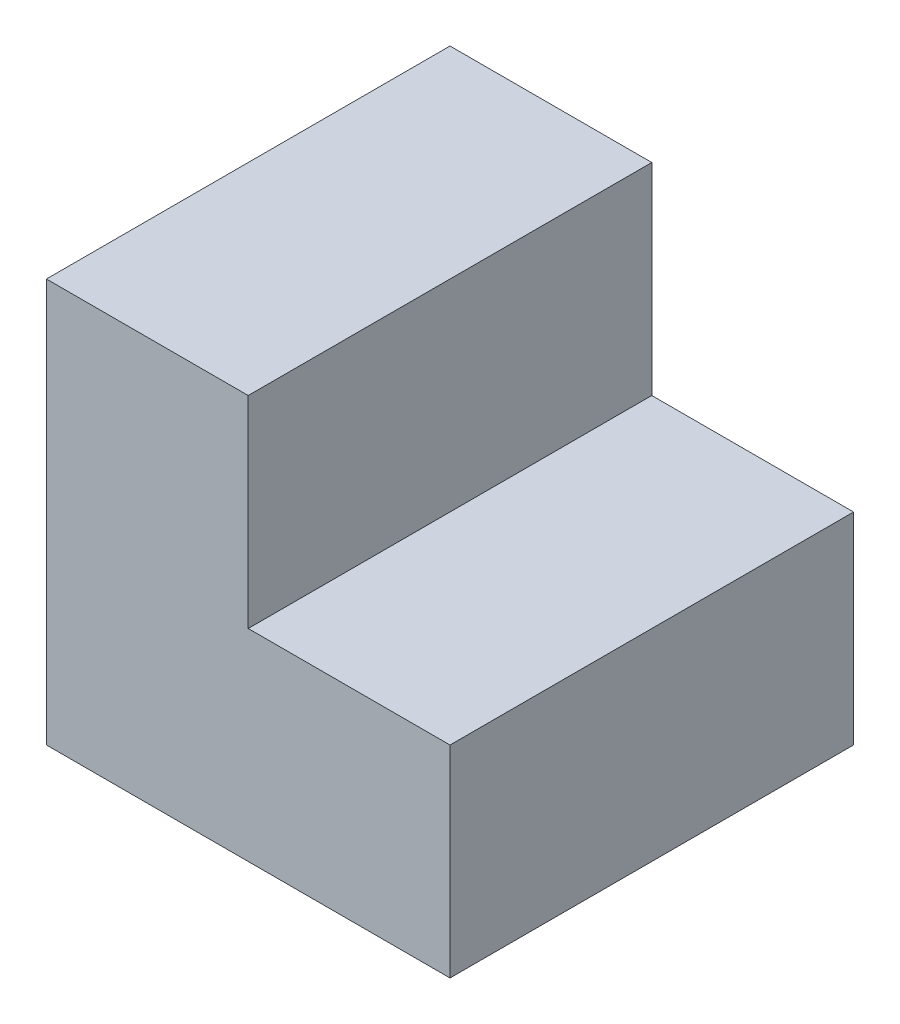
ISO-10303-21;
HEADER;
FILE_DESCRIPTION(('STEP AP214'),'2;1');
FILE_NAME('part.step','',(''),(''),'','','');
FILE_SCHEMA(('AUTOMOTIVE_DESIGN { 1 0 10303 214 1 1 1 1 }'));
ENDSEC;
DATA;
#1=APPLICATION_CONTEXT('core data for automotive mechanical design processes');
#2=APPLICATION_PROTOCOL_DEFINITION('international standard','automotive_design',2000,#1);
#3=PRODUCT_CONTEXT('',#1,'mechanical');
#4=PRODUCT('Part','Part','',(#3));
#5=PRODUCT_RELATED_PRODUCT_CATEGORY('part','',(#4));
#6=PRODUCT_DEFINITION_FORMATION('','',#4);
#7=PRODUCT_DEFINITION_CONTEXT('part definition',#1,'design');
#8=PRODUCT_DEFINITION('design','',#6,#7);
#9=PRODUCT_DEFINITION_SHAPE('','',#8);
#10=(LENGTH_UNIT() NAMED_UNIT(*) SI_UNIT(.MILLI.,.METRE.));
#11=(NAMED_UNIT(*) PLANE_ANGLE_UNIT() SI_UNIT($,.RADIAN.));
#12=(NAMED_UNIT(*) SI_UNIT($,.STERADIAN.) SOLID_ANGLE_UNIT());
#13=UNCERTAINTY_MEASURE_WITH_UNIT(LENGTH_MEASURE(1.E-05),#10,'distance_accuracy_value','');
#14=(GEOMETRIC_REPRESENTATION_CONTEXT(3) GLOBAL_UNCERTAINTY_ASSIGNED_CONTEXT((#13)) GLOBAL_UNIT_ASSIGNED_CONTEXT((#10,
#11,#12)) REPRESENTATION_CONTEXT('',''));
#15=CARTESIAN_POINT('',(0.,0.,0.));
#16=DIRECTION('',(0.,0.,1.));
#17=DIRECTION('',(1.,0.,0.));
#18=AXIS2_PLACEMENT_3D('',#15,#16,#17);
#19=CARTESIAN_POINT('',(80.,40.,-80.));
#20=DIRECTION('',(0.,1.,0.));
#21=DIRECTION('',(-1.,0.,0.));
#22=AXIS2_PLACEMENT_3D('',#19,#20,#21);
#23=PLANE('',#22);
#24=DIRECTION('',(-1.,0.,0.));
#25=VECTOR('',#24,1.);
#26=CARTESIAN_POINT('',(80.,40.,0.));
#27=LINE('',#26,#25);
#28=CARTESIAN_POINT('',(80.,40.,0.));
#29=VERTEX_POINT('',#28);
#30=CARTESIAN_POINT('',(40.,40.,0.));
#31=VERTEX_POINT('',#30);
#32=EDGE_CURVE('E118',#29,#31,#27,.T.);
#33=ORIENTED_EDGE('',*,*,#32,.F.);
#34=DIRECTION('',(0.,0.,1.));
#35=VECTOR('',#34,1.);
#36=CARTESIAN_POINT('',(80.,40.,-80.));
#37=LINE('',#36,#35);
#38=CARTESIAN_POINT('',(80.,40.,-80.));
#39=VERTEX_POINT('',#38);
#40=EDGE_CURVE('E11',#39,#29,#37,.T.);
#41=ORIENTED_EDGE('',*,*,#40,.F.);
#42=DIRECTION('',(-1.,0.,0.));
#43=VECTOR('',#42,1.);
#44=CARTESIAN_POINT('',(80.,40.,-80.));
#45=LINE('',#44,#43);
#46=CARTESIAN_POINT('',(40.,40.,-80.));
#47=VERTEX_POINT('',#46);
#48=EDGE_CURVE('E132',#39,#47,#45,.T.);
#49=ORIENTED_EDGE('',*,*,#48,.T.);
#50=DIRECTION('',(0.,0.,1.));
#51=VECTOR('',#50,1.);
#52=CARTESIAN_POINT('',(40.,40.,-80.));
#53=LINE('',#52,#51);
#54=EDGE_CURVE('E36',#47,#31,#53,.T.);
#55=ORIENTED_EDGE('',*,*,#54,.T.);
#56=EDGE_LOOP('',(#33,#41,#49,#55));
#57=FACE_BOUND('',#56,.T.);
#58=ADVANCED_FACE('F33',(#57),#23,.T.);
#59=CARTESIAN_POINT('',(80.,0.,-80.));
#60=DIRECTION('',(1.,0.,0.));
#61=DIRECTION('',(0.,0.,-1.));
#62=AXIS2_PLACEMENT_3D('',#59,#60,#61);
#63=PLANE('',#62);
#64=DIRECTION('',(0.,1.,0.));
#65=VECTOR('',#64,1.);
#66=CARTESIAN_POINT('',(80.,0.,0.));
#67=LINE('',#66,#65);
#68=CARTESIAN_POINT('',(80.,0.,0.));
#69=VERTEX_POINT('',#68);
#70=EDGE_CURVE('E130',#69,#29,#67,.T.);
#71=ORIENTED_EDGE('',*,*,#70,.F.);
#72=DIRECTION('',(0.,0.,1.));
#73=VECTOR('',#72,1.);
#74=CARTESIAN_POINT('',(80.,0.,-80.));
#75=LINE('',#74,#73);
#76=CARTESIAN_POINT('',(80.,0.,-80.));
#77=VERTEX_POINT('',#76);
#78=EDGE_CURVE('E42',#77,#69,#75,.T.);
#79=ORIENTED_EDGE('',*,*,#78,.F.);
#80=DIRECTION('',(0.,1.,0.));
#81=VECTOR('',#80,1.);
#82=CARTESIAN_POINT('',(80.,0.,-80.));
#83=LINE('',#82,#81);
#84=EDGE_CURVE('E108',#77,#39,#83,.T.);
#85=ORIENTED_EDGE('',*,*,#84,.T.);
#86=ORIENTED_EDGE('',*,*,#40,.T.);
#87=EDGE_LOOP('',(#71,#79,#85,#86));
#88=FACE_BOUND('',#87,.T.);
#89=ADVANCED_FACE('F140',(#88),#63,.T.);
#90=CARTESIAN_POINT('',(0.,0.,-80.));
#91=DIRECTION('',(0.,-1.,0.));
#92=DIRECTION('',(0.,0.,-1.));
#93=AXIS2_PLACEMENT_3D('',#90,#91,#92);
#94=PLANE('',#93);
#95=DIRECTION('',(1.,0.,0.));
#96=VECTOR('',#95,1.);
#97=CARTESIAN_POINT('',(0.,0.,0.));
#98=LINE('',#97,#96);
#99=CARTESIAN_POINT('',(0.,0.,0.));
#100=VERTEX_POINT('',#99);
#101=EDGE_CURVE('E95',#100,#69,#98,.T.);
#102=ORIENTED_EDGE('',*,*,#101,.F.);
#103=DIRECTION('',(0.,0.,1.));
#104=VECTOR('',#103,1.);
#105=CARTESIAN_POINT('',(0.,0.,-80.));
#106=LINE('',#105,#104);
#107=CARTESIAN_POINT('',(0.,0.,-80.));
#108=VERTEX_POINT('',#107);
#109=EDGE_CURVE('E90',#108,#100,#106,.T.);
#110=ORIENTED_EDGE('',*,*,#109,.F.);
#111=DIRECTION('',(1.,0.,0.));
#112=VECTOR('',#111,1.);
#113=CARTESIAN_POINT('',(0.,0.,-80.));
#114=LINE('',#113,#112);
#115=EDGE_CURVE('E93',#108,#77,#114,.T.);
#116=ORIENTED_EDGE('',*,*,#115,.T.);
#117=ORIENTED_EDGE('',*,*,#78,.T.);
#118=EDGE_LOOP('',(#102,#110,#116,#117));
#119=FACE_BOUND('',#118,.T.);
#120=ADVANCED_FACE('F92',(#119),#94,.T.);
#121=CARTESIAN_POINT('',(0.,80.,-80.));
#122=DIRECTION('',(-1.,0.,0.));
#123=DIRECTION('',(0.,-1.,0.));
#124=AXIS2_PLACEMENT_3D('',#121,#122,#123);
#125=PLANE('',#124);
#126=DIRECTION('',(0.,-1.,0.));
#127=VECTOR('',#126,1.);
#128=CARTESIAN_POINT('',(0.,80.,0.));
#129=LINE('',#128,#127);
#130=CARTESIAN_POINT('',(0.,80.,0.));
#131=VERTEX_POINT('',#130);
#132=EDGE_CURVE('E127',#131,#100,#129,.T.);
#133=ORIENTED_EDGE('',*,*,#132,.F.);
#134=DIRECTION('',(0.,0.,1.));
#135=VECTOR('',#134,1.);
#136=CARTESIAN_POINT('',(0.,80.,-80.));
#137=LINE('',#136,#135);
#138=CARTESIAN_POINT('',(0.,80.,-80.));
#139=VERTEX_POINT('',#138);
#140=EDGE_CURVE('E100',#139,#131,#137,.T.);
#141=ORIENTED_EDGE('',*,*,#140,.F.);
#142=DIRECTION('',(0.,-1.,0.));
#143=VECTOR('',#142,1.);
#144=CARTESIAN_POINT('',(0.,80.,-80.));
#145=LINE('',#144,#143);
#146=EDGE_CURVE('E106',#139,#108,#145,.T.);
#147=ORIENTED_EDGE('',*,*,#146,.T.);
#148=ORIENTED_EDGE('',*,*,#109,.T.);
#149=EDGE_LOOP('',(#133,#141,#147,#148));
#150=FACE_BOUND('',#149,.T.);
#151=ADVANCED_FACE('F110',(#150),#125,.T.);
#152=CARTESIAN_POINT('',(40.,80.,-80.));
#153=DIRECTION('',(0.,1.,0.));
#154=DIRECTION('',(-1.,0.,0.));
#155=AXIS2_PLACEMENT_3D('',#152,#153,#154);
#156=PLANE('',#155);
#157=DIRECTION('',(-1.,0.,0.));
#158=VECTOR('',#157,1.);
#159=CARTESIAN_POINT('',(40.,80.,0.));
#160=LINE('',#159,#158);
#161=CARTESIAN_POINT('',(40.,80.,0.));
#162=VERTEX_POINT('',#161);
#163=EDGE_CURVE('E124',#162,#131,#160,.T.);
#164=ORIENTED_EDGE('',*,*,#163,.F.);
#165=DIRECTION('',(0.,0.,1.));
#166=VECTOR('',#165,1.);
#167=CARTESIAN_POINT('',(40.,80.,-80.));
#168=LINE('',#167,#166);
#169=CARTESIAN_POINT('',(40.,80.,-80.));
#170=VERTEX_POINT('',#169);
#171=EDGE_CURVE('E135',#170,#162,#168,.T.);
#172=ORIENTED_EDGE('',*,*,#171,.F.);
#173=DIRECTION('',(-1.,0.,0.));
#174=VECTOR('',#173,1.);
#175=CARTESIAN_POINT('',(40.,80.,-80.));
#176=LINE('',#175,#174);
#177=EDGE_CURVE('E111',#170,#139,#176,.T.);
#178=ORIENTED_EDGE('',*,*,#177,.T.);
#179=ORIENTED_EDGE('',*,*,#140,.T.);
#180=EDGE_LOOP('',(#164,#172,#178,#179));
#181=FACE_BOUND('',#180,.T.);
#182=ADVANCED_FACE('F153',(#181),#156,.T.);
#183=CARTESIAN_POINT('',(40.,40.,-80.));
#184=DIRECTION('',(1.,0.,0.));
#185=DIRECTION('',(0.,1.,0.));
#186=AXIS2_PLACEMENT_3D('',#183,#184,#185);
#187=PLANE('',#186);
#188=DIRECTION('',(0.,1.,0.));
#189=VECTOR('',#188,1.);
#190=CARTESIAN_POINT('',(40.,40.,0.));
#191=LINE('',#190,#189);
#192=EDGE_CURVE('E121',#31,#162,#191,.T.);
#193=ORIENTED_EDGE('',*,*,#192,.F.);
#194=ORIENTED_EDGE('',*,*,#54,.F.);
#195=DIRECTION('',(0.,1.,0.));
#196=VECTOR('',#195,1.);
#197=CARTESIAN_POINT('',(40.,40.,-80.));
#198=LINE('',#197,#196);
#199=EDGE_CURVE('E113',#47,#170,#198,.T.);
#200=ORIENTED_EDGE('',*,*,#199,.T.);
#201=ORIENTED_EDGE('',*,*,#171,.T.);
#202=EDGE_LOOP('',(#193,#194,#200,#201));
#203=FACE_BOUND('',#202,.T.);
#204=ADVANCED_FACE('F137',(#203),#187,.T.);
#205=CARTESIAN_POINT('',(0.,0.,-80.));
#206=DIRECTION('',(0.,0.,-1.));
#207=DIRECTION('',(-1.,0.,0.));
#208=AXIS2_PLACEMENT_3D('',#205,#206,#207);
#209=PLANE('',#208);
#210=ORIENTED_EDGE('',*,*,#48,.F.);
#211=ORIENTED_EDGE('',*,*,#84,.F.);
#212=ORIENTED_EDGE('',*,*,#115,.F.);
#213=ORIENTED_EDGE('',*,*,#146,.F.);
#214=ORIENTED_EDGE('',*,*,#177,.F.);
#215=ORIENTED_EDGE('',*,*,#199,.F.);
#216=EDGE_LOOP('',(#210,#211,#212,#213,#214,#215));
#217=FACE_BOUND('',#216,.T.);
#218=ADVANCED_FACE('F104',(#217),#209,.T.);
#219=CARTESIAN_POINT('',(0.,0.,0.));
#220=DIRECTION('',(0.,0.,-1.));
#221=DIRECTION('',(-1.,0.,0.));
#222=AXIS2_PLACEMENT_3D('',#219,#220,#221);
#223=PLANE('',#222);
#224=ORIENTED_EDGE('',*,*,#32,.T.);
#225=ORIENTED_EDGE('',*,*,#192,.T.);
#226=ORIENTED_EDGE('',*,*,#163,.T.);
#227=ORIENTED_EDGE('',*,*,#132,.T.);
#228=ORIENTED_EDGE('',*,*,#101,.T.);
#229=ORIENTED_EDGE('',*,*,#70,.T.);
#230=EDGE_LOOP('',(#224,#225,#226,#227,#228,#229));
#231=FACE_BOUND('',#230,.T.);
#232=ADVANCED_FACE('F139',(#231),#223,.F.);
#233=CLOSED_SHELL('',(#58,#89,#120,#151,#182,#204,#218,#232));
#234=MANIFOLD_SOLID_BREP('B2',#233);
#235=ADVANCED_BREP_SHAPE_REPRESENTATION('',(#18,#234),#14);
#236=SHAPE_DEFINITION_REPRESENTATION(#9,#235);
ENDSEC;
END-ISO-10303-21;
